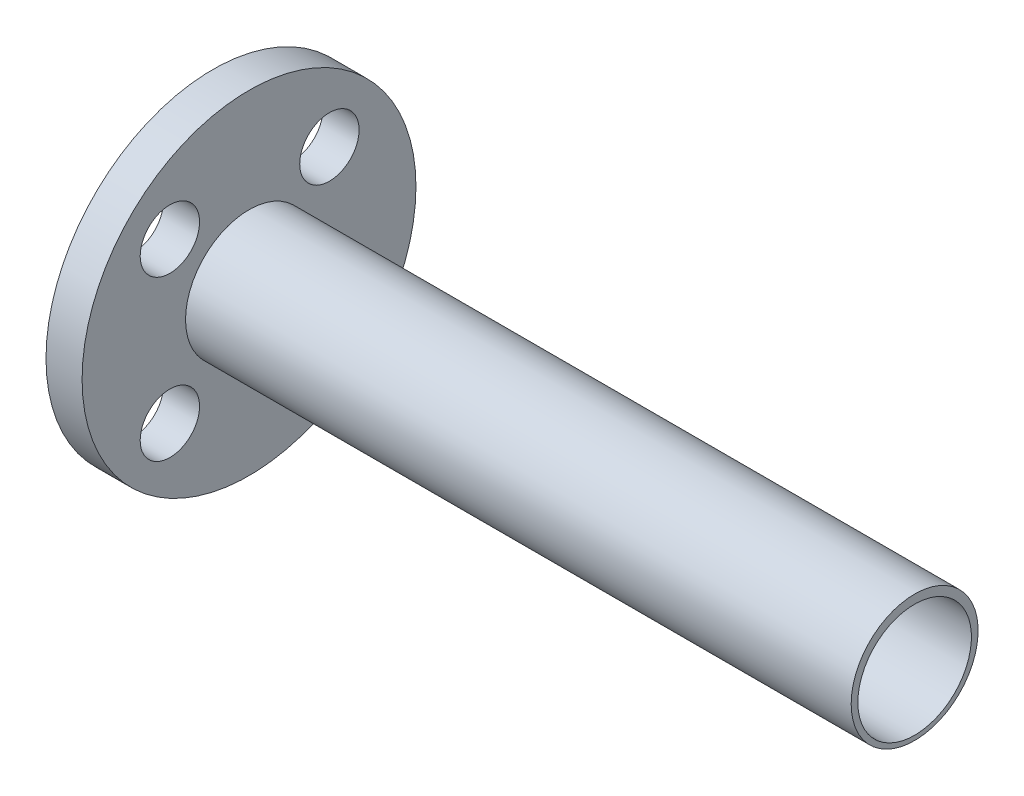
ISO-10303-21;
HEADER;
FILE_DESCRIPTION(('STEP AP214'),'2;1');
FILE_NAME('part.step','',(''),(''),'','','');
FILE_SCHEMA(('AUTOMOTIVE_DESIGN { 1 0 10303 214 1 1 1 1 }'));
ENDSEC;
DATA;
#1=APPLICATION_CONTEXT('core data for automotive mechanical design processes');
#2=APPLICATION_PROTOCOL_DEFINITION('international standard','automotive_design',2000,#1);
#3=PRODUCT_CONTEXT('',#1,'mechanical');
#4=PRODUCT('Part','Part','',(#3));
#5=PRODUCT_RELATED_PRODUCT_CATEGORY('part','',(#4));
#6=PRODUCT_DEFINITION_FORMATION('','',#4);
#7=PRODUCT_DEFINITION_CONTEXT('part definition',#1,'design');
#8=PRODUCT_DEFINITION('design','',#6,#7);
#9=PRODUCT_DEFINITION_SHAPE('','',#8);
#10=(LENGTH_UNIT() NAMED_UNIT(*) SI_UNIT(.MILLI.,.METRE.));
#11=(NAMED_UNIT(*) PLANE_ANGLE_UNIT() SI_UNIT($,.RADIAN.));
#12=(NAMED_UNIT(*) SI_UNIT($,.STERADIAN.) SOLID_ANGLE_UNIT());
#13=UNCERTAINTY_MEASURE_WITH_UNIT(LENGTH_MEASURE(1.E-05),#10,'distance_accuracy_value','');
#14=(GEOMETRIC_REPRESENTATION_CONTEXT(3) GLOBAL_UNCERTAINTY_ASSIGNED_CONTEXT((#13)) GLOBAL_UNIT_ASSIGNED_CONTEXT((#10,
#11,#12)) REPRESENTATION_CONTEXT('',''));
#15=CARTESIAN_POINT('',(0.,0.,0.));
#16=DIRECTION('',(0.,0.,1.));
#17=DIRECTION('',(1.,0.,0.));
#18=AXIS2_PLACEMENT_3D('',#15,#16,#17);
#19=CARTESIAN_POINT('',(240.061523502043,17.526,0.));
#20=DIRECTION('',(-1.,0.,0.));
#21=DIRECTION('',(0.,0.,1.));
#22=AXIS2_PLACEMENT_3D('',#19,#20,#21);
#23=PLANE('',#22);
#24=CARTESIAN_POINT('',(240.061523502043,0.,0.));
#25=DIRECTION('',(-1.,0.,0.));
#26=DIRECTION('',(0.,0.,1.));
#27=AXIS2_PLACEMENT_3D('',#24,#25,#26);
#28=CIRCLE('',#27,15.18);
#29=CARTESIAN_POINT('',(240.061523502043,0.,15.18));
#30=VERTEX_POINT('',#29);
#31=EDGE_CURVE('E56',#30,#30,#28,.T.);
#32=ORIENTED_EDGE('',*,*,#31,.T.);
#33=EDGE_LOOP('',(#32));
#34=FACE_BOUND('',#33,.T.);
#35=CARTESIAN_POINT('',(240.061523502043,0.555053367468368,0.));
#36=DIRECTION('',(-1.,0.,0.));
#37=DIRECTION('',(0.,0.,1.));
#38=AXIS2_PLACEMENT_3D('',#35,#36,#37);
#39=CIRCLE('',#38,16.9709466325316);
#40=CARTESIAN_POINT('',(240.061523502043,0.555053367468368,16.9709466325316));
#41=VERTEX_POINT('',#40);
#42=EDGE_CURVE('E10',#41,#41,#39,.T.);
#43=ORIENTED_EDGE('',*,*,#42,.F.);
#44=EDGE_LOOP('',(#43));
#45=FACE_BOUND('',#44,.T.);
#46=ADVANCED_FACE('F31',(#34,#45),#23,.F.);
#47=CARTESIAN_POINT('',(53.975,0.555053367468368,0.));
#48=DIRECTION('',(-1.,0.,0.));
#49=DIRECTION('',(0.,0.,1.));
#50=AXIS2_PLACEMENT_3D('',#47,#48,#49);
#51=CYLINDRICAL_SURFACE('',#50,16.9709466325316);
#52=CARTESIAN_POINT('',(62.101,0.555053367468368,0.));
#53=DIRECTION('',(-1.,0.,0.));
#54=DIRECTION('',(0.,0.,1.));
#55=AXIS2_PLACEMENT_3D('',#52,#53,#54);
#56=CIRCLE('',#55,16.9709466325316);
#57=CARTESIAN_POINT('',(62.101,0.555053367468368,16.9709466325316));
#58=VERTEX_POINT('',#57);
#59=EDGE_CURVE('E37',#58,#58,#56,.T.);
#60=ORIENTED_EDGE('',*,*,#59,.F.);
#61=EDGE_LOOP('',(#60));
#62=FACE_BOUND('',#61,.T.);
#63=ORIENTED_EDGE('',*,*,#42,.T.);
#64=EDGE_LOOP('',(#63));
#65=FACE_BOUND('',#64,.T.);
#66=ADVANCED_FACE('F110',(#62,#65),#51,.T.);
#67=CARTESIAN_POINT('',(62.101,45.1853786066323,0.));
#68=DIRECTION('',(-1.,0.,0.));
#69=DIRECTION('',(0.,0.,1.));
#70=AXIS2_PLACEMENT_3D('',#67,#68,#69);
#71=PLANE('',#70);
#72=CARTESIAN_POINT('',(62.101,-21.341981673475,-21.4944164304282));
#73=DIRECTION('',(-1.,0.,0.));
#74=DIRECTION('',(0.,0.,1.));
#75=AXIS2_PLACEMENT_3D('',#72,#73,#74);
#76=CIRCLE('',#75,7.9375);
#77=CARTESIAN_POINT('',(62.101,-21.341981673475,-13.5569164304282));
#78=VERTEX_POINT('',#77);
#79=EDGE_CURVE('E60',#78,#78,#76,.T.);
#80=ORIENTED_EDGE('',*,*,#79,.T.);
#81=EDGE_LOOP('',(#80));
#82=FACE_BOUND('',#81,.T.);
#83=CARTESIAN_POINT('',(62.101,21.3142349016032,21.1618001446505));
#84=DIRECTION('',(-1.,0.,0.));
#85=DIRECTION('',(0.,0.,1.));
#86=AXIS2_PLACEMENT_3D('',#83,#84,#85);
#87=CIRCLE('',#86,7.9375);
#88=CARTESIAN_POINT('',(62.101,21.3142349016032,29.0993001446505));
#89=VERTEX_POINT('',#88);
#90=EDGE_CURVE('E65',#89,#89,#87,.T.);
#91=ORIENTED_EDGE('',*,*,#90,.T.);
#92=EDGE_LOOP('',(#91));
#93=FACE_BOUND('',#92,.T.);
#94=CARTESIAN_POINT('',(62.101,-21.3419816734753,21.1618001446503));
#95=DIRECTION('',(-1.,0.,0.));
#96=DIRECTION('',(0.,0.,1.));
#97=AXIS2_PLACEMENT_3D('',#94,#95,#96);
#98=CIRCLE('',#97,7.9375);
#99=CARTESIAN_POINT('',(62.101,-21.3419816734753,29.0993001446503));
#100=VERTEX_POINT('',#99);
#101=EDGE_CURVE('E68',#100,#100,#98,.T.);
#102=ORIENTED_EDGE('',*,*,#101,.T.);
#103=EDGE_LOOP('',(#102));
#104=FACE_BOUND('',#103,.T.);
#105=CARTESIAN_POINT('',(62.101,21.3142349016035,-21.4944164304278));
#106=DIRECTION('',(-1.,0.,0.));
#107=DIRECTION('',(0.,0.,1.));
#108=AXIS2_PLACEMENT_3D('',#105,#106,#107);
#109=CIRCLE('',#108,7.9375);
#110=CARTESIAN_POINT('',(62.101,21.3142349016035,-13.5569164304278));
#111=VERTEX_POINT('',#110);
#112=EDGE_CURVE('E71',#111,#111,#109,.T.);
#113=ORIENTED_EDGE('',*,*,#112,.T.);
#114=EDGE_LOOP('',(#113));
#115=FACE_BOUND('',#114,.T.);
#116=CARTESIAN_POINT('',(62.101,0.555053367468368,0.));
#117=DIRECTION('',(-1.,0.,0.));
#118=DIRECTION('',(0.,0.,1.));
#119=AXIS2_PLACEMENT_3D('',#116,#117,#118);
#120=CIRCLE('',#119,44.6303252391639);
#121=CARTESIAN_POINT('',(62.101,0.555053367468368,44.6303252391639));
#122=VERTEX_POINT('',#121);
#123=EDGE_CURVE('E41',#122,#122,#120,.T.);
#124=ORIENTED_EDGE('',*,*,#123,.F.);
#125=EDGE_LOOP('',(#124));
#126=FACE_BOUND('',#125,.T.);
#127=ORIENTED_EDGE('',*,*,#59,.T.);
#128=EDGE_LOOP('',(#127));
#129=FACE_BOUND('',#128,.T.);
#130=ADVANCED_FACE('F105',(#82,#93,#104,#115,#126,#129),#71,.F.);
#131=CARTESIAN_POINT('',(53.975,0.555053367468368,0.));
#132=DIRECTION('',(-1.,0.,0.));
#133=DIRECTION('',(0.,0.,1.));
#134=AXIS2_PLACEMENT_3D('',#131,#132,#133);
#135=CYLINDRICAL_SURFACE('',#134,44.6303252391639);
#136=CARTESIAN_POINT('',(52.451,0.555053367468368,0.));
#137=DIRECTION('',(-1.,0.,0.));
#138=DIRECTION('',(0.,0.,1.));
#139=AXIS2_PLACEMENT_3D('',#136,#137,#138);
#140=CIRCLE('',#139,44.6303252391639);
#141=CARTESIAN_POINT('',(52.451,0.555053367468368,44.6303252391639));
#142=VERTEX_POINT('',#141);
#143=EDGE_CURVE('E45',#142,#142,#140,.T.);
#144=ORIENTED_EDGE('',*,*,#143,.F.);
#145=EDGE_LOOP('',(#144));
#146=FACE_BOUND('',#145,.T.);
#147=ORIENTED_EDGE('',*,*,#123,.T.);
#148=EDGE_LOOP('',(#147));
#149=FACE_BOUND('',#148,.T.);
#150=ADVANCED_FACE('F94',(#146,#149),#135,.T.);
#151=CARTESIAN_POINT('',(52.451,17.526,0.));
#152=DIRECTION('',(1.,0.,0.));
#153=DIRECTION('',(0.,0.,-1.));
#154=AXIS2_PLACEMENT_3D('',#151,#152,#153);
#155=PLANE('',#154);
#156=CARTESIAN_POINT('',(52.451,-21.341981673475,-21.4944164304282));
#157=DIRECTION('',(-1.,0.,0.));
#158=DIRECTION('',(0.,0.,1.));
#159=AXIS2_PLACEMENT_3D('',#156,#157,#158);
#160=CIRCLE('',#159,7.9375);
#161=CARTESIAN_POINT('',(52.451,-21.341981673475,-13.5569164304282));
#162=VERTEX_POINT('',#161);
#163=EDGE_CURVE('E77',#162,#162,#160,.T.);
#164=ORIENTED_EDGE('',*,*,#163,.F.);
#165=EDGE_LOOP('',(#164));
#166=FACE_BOUND('',#165,.T.);
#167=CARTESIAN_POINT('',(52.451,21.3142349016032,21.1618001446505));
#168=DIRECTION('',(-1.,0.,0.));
#169=DIRECTION('',(0.,0.,1.));
#170=AXIS2_PLACEMENT_3D('',#167,#168,#169);
#171=CIRCLE('',#170,7.9375);
#172=CARTESIAN_POINT('',(52.451,21.3142349016032,29.0993001446505));
#173=VERTEX_POINT('',#172);
#174=EDGE_CURVE('E78',#173,#173,#171,.T.);
#175=ORIENTED_EDGE('',*,*,#174,.F.);
#176=EDGE_LOOP('',(#175));
#177=FACE_BOUND('',#176,.T.);
#178=CARTESIAN_POINT('',(52.451,-21.3419816734753,21.1618001446503));
#179=DIRECTION('',(-1.,0.,0.));
#180=DIRECTION('',(0.,0.,1.));
#181=AXIS2_PLACEMENT_3D('',#178,#179,#180);
#182=CIRCLE('',#181,7.9375);
#183=CARTESIAN_POINT('',(52.451,-21.3419816734753,29.0993001446503));
#184=VERTEX_POINT('',#183);
#185=EDGE_CURVE('E81',#184,#184,#182,.T.);
#186=ORIENTED_EDGE('',*,*,#185,.F.);
#187=EDGE_LOOP('',(#186));
#188=FACE_BOUND('',#187,.T.);
#189=CARTESIAN_POINT('',(52.451,21.3142349016035,-21.4944164304278));
#190=DIRECTION('',(-1.,0.,0.));
#191=DIRECTION('',(0.,0.,1.));
#192=AXIS2_PLACEMENT_3D('',#189,#190,#191);
#193=CIRCLE('',#192,7.9375);
#194=CARTESIAN_POINT('',(52.451,21.3142349016035,-13.5569164304278));
#195=VERTEX_POINT('',#194);
#196=EDGE_CURVE('E74',#195,#195,#193,.T.);
#197=ORIENTED_EDGE('',*,*,#196,.F.);
#198=EDGE_LOOP('',(#197));
#199=FACE_BOUND('',#198,.T.);
#200=CARTESIAN_POINT('',(52.451,0.555053367468368,0.));
#201=DIRECTION('',(-1.,0.,0.));
#202=DIRECTION('',(0.,0.,1.));
#203=AXIS2_PLACEMENT_3D('',#200,#201,#202);
#204=CIRCLE('',#203,16.9709466325316);
#205=CARTESIAN_POINT('',(52.451,0.555053367468368,16.9709466325316));
#206=VERTEX_POINT('',#205);
#207=EDGE_CURVE('E50',#206,#206,#204,.T.);
#208=ORIENTED_EDGE('',*,*,#207,.F.);
#209=EDGE_LOOP('',(#208));
#210=FACE_BOUND('',#209,.T.);
#211=ORIENTED_EDGE('',*,*,#143,.T.);
#212=EDGE_LOOP('',(#211));
#213=FACE_BOUND('',#212,.T.);
#214=ADVANCED_FACE('F90',(#166,#177,#188,#199,#210,#213),#155,.F.);
#215=CARTESIAN_POINT('',(53.975,0.555053367468368,0.));
#216=DIRECTION('',(-1.,0.,0.));
#217=DIRECTION('',(0.,0.,1.));
#218=AXIS2_PLACEMENT_3D('',#215,#216,#217);
#219=CYLINDRICAL_SURFACE('',#218,16.9709466325316);
#220=CARTESIAN_POINT('',(53.975,0.555053367468368,0.));
#221=DIRECTION('',(-1.,0.,0.));
#222=DIRECTION('',(0.,0.,1.));
#223=AXIS2_PLACEMENT_3D('',#220,#221,#222);
#224=CIRCLE('',#223,16.9709466325316);
#225=CARTESIAN_POINT('',(53.975,0.555053367468368,16.9709466325316));
#226=VERTEX_POINT('',#225);
#227=EDGE_CURVE('E53',#226,#226,#224,.T.);
#228=ORIENTED_EDGE('',*,*,#227,.F.);
#229=EDGE_LOOP('',(#228));
#230=FACE_BOUND('',#229,.T.);
#231=ORIENTED_EDGE('',*,*,#207,.T.);
#232=EDGE_LOOP('',(#231));
#233=FACE_BOUND('',#232,.T.);
#234=ADVANCED_FACE('F93',(#230,#233),#219,.F.);
#235=CARTESIAN_POINT('',(53.975,0.555053367468368,0.));
#236=DIRECTION('',(1.,0.,0.));
#237=DIRECTION('',(0.,0.,-1.));
#238=AXIS2_PLACEMENT_3D('',#235,#236,#237);
#239=PLANE('',#238);
#240=CARTESIAN_POINT('',(53.975,0.,0.));
#241=DIRECTION('',(-1.,0.,0.));
#242=DIRECTION('',(0.,0.,1.));
#243=AXIS2_PLACEMENT_3D('',#240,#241,#242);
#244=CIRCLE('',#243,15.18);
#245=CARTESIAN_POINT('',(53.975,0.,15.18));
#246=VERTEX_POINT('',#245);
#247=EDGE_CURVE('E57',#246,#246,#244,.T.);
#248=ORIENTED_EDGE('',*,*,#247,.F.);
#249=EDGE_LOOP('',(#248));
#250=FACE_BOUND('',#249,.T.);
#251=ORIENTED_EDGE('',*,*,#227,.T.);
#252=EDGE_LOOP('',(#251));
#253=FACE_BOUND('',#252,.T.);
#254=ADVANCED_FACE('F129',(#250,#253),#239,.F.);
#255=CARTESIAN_POINT('',(240.061523502043,0.,0.));
#256=DIRECTION('',(-1.,0.,0.));
#257=DIRECTION('',(0.,0.,1.));
#258=AXIS2_PLACEMENT_3D('',#255,#256,#257);
#259=CYLINDRICAL_SURFACE('',#258,15.18);
#260=ORIENTED_EDGE('',*,*,#31,.F.);
#261=EDGE_LOOP('',(#260));
#262=FACE_BOUND('',#261,.T.);
#263=ORIENTED_EDGE('',*,*,#247,.T.);
#264=EDGE_LOOP('',(#263));
#265=FACE_BOUND('',#264,.T.);
#266=ADVANCED_FACE('F125',(#262,#265),#259,.F.);
#267=CARTESIAN_POINT('',(62.451,21.3142349016035,-21.4944164304278));
#268=DIRECTION('',(-1.,0.,0.));
#269=DIRECTION('',(0.,0.,1.));
#270=AXIS2_PLACEMENT_3D('',#267,#268,#269);
#271=CYLINDRICAL_SURFACE('',#270,7.9375);
#272=ORIENTED_EDGE('',*,*,#196,.T.);
#273=EDGE_LOOP('',(#272));
#274=FACE_BOUND('',#273,.T.);
#275=ORIENTED_EDGE('',*,*,#112,.F.);
#276=EDGE_LOOP('',(#275));
#277=FACE_BOUND('',#276,.T.);
#278=ADVANCED_FACE('F128',(#274,#277),#271,.F.);
#279=CARTESIAN_POINT('',(62.451,-21.3419816734753,21.1618001446503));
#280=DIRECTION('',(-1.,0.,0.));
#281=DIRECTION('',(0.,0.,1.));
#282=AXIS2_PLACEMENT_3D('',#279,#280,#281);
#283=CYLINDRICAL_SURFACE('',#282,7.9375);
#284=ORIENTED_EDGE('',*,*,#185,.T.);
#285=EDGE_LOOP('',(#284));
#286=FACE_BOUND('',#285,.T.);
#287=ORIENTED_EDGE('',*,*,#101,.F.);
#288=EDGE_LOOP('',(#287));
#289=FACE_BOUND('',#288,.T.);
#290=ADVANCED_FACE('F87',(#286,#289),#283,.F.);
#291=CARTESIAN_POINT('',(62.451,21.3142349016032,21.1618001446505));
#292=DIRECTION('',(-1.,0.,0.));
#293=DIRECTION('',(0.,0.,1.));
#294=AXIS2_PLACEMENT_3D('',#291,#292,#293);
#295=CYLINDRICAL_SURFACE('',#294,7.9375);
#296=ORIENTED_EDGE('',*,*,#174,.T.);
#297=EDGE_LOOP('',(#296));
#298=FACE_BOUND('',#297,.T.);
#299=ORIENTED_EDGE('',*,*,#90,.F.);
#300=EDGE_LOOP('',(#299));
#301=FACE_BOUND('',#300,.T.);
#302=ADVANCED_FACE('F147',(#298,#301),#295,.F.);
#303=CARTESIAN_POINT('',(62.451,-21.341981673475,-21.4944164304282));
#304=DIRECTION('',(-1.,0.,0.));
#305=DIRECTION('',(0.,0.,1.));
#306=AXIS2_PLACEMENT_3D('',#303,#304,#305);
#307=CYLINDRICAL_SURFACE('',#306,7.9375);
#308=ORIENTED_EDGE('',*,*,#163,.T.);
#309=EDGE_LOOP('',(#308));
#310=FACE_BOUND('',#309,.T.);
#311=ORIENTED_EDGE('',*,*,#79,.F.);
#312=EDGE_LOOP('',(#311));
#313=FACE_BOUND('',#312,.T.);
#314=ADVANCED_FACE('F150',(#310,#313),#307,.F.);
#315=CLOSED_SHELL('',(#46,#66,#130,#150,#214,#234,#254,#266,#278,#290,#302,#314));
#316=MANIFOLD_SOLID_BREP('B2',#315);
#317=ADVANCED_BREP_SHAPE_REPRESENTATION('',(#18,#316),#14);
#318=SHAPE_DEFINITION_REPRESENTATION(#9,#317);
ENDSEC;
END-ISO-10303-21;
